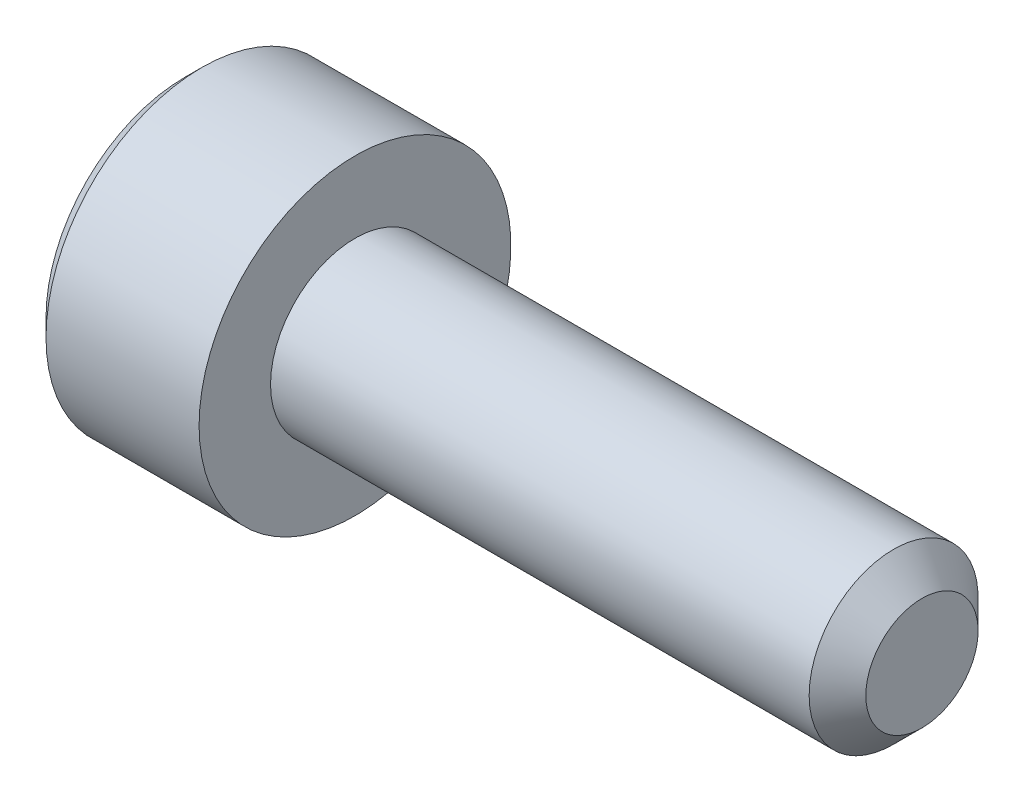
ISO-10303-21;
HEADER;
FILE_DESCRIPTION(('STEP AP214'),'2;1');
FILE_NAME('part.step','',(''),(''),'','','');
FILE_SCHEMA(('AUTOMOTIVE_DESIGN { 1 0 10303 214 1 1 1 1 }'));
ENDSEC;
DATA;
#1=APPLICATION_CONTEXT('core data for automotive mechanical design processes');
#2=APPLICATION_PROTOCOL_DEFINITION('international standard','automotive_design',2000,#1);
#3=PRODUCT_CONTEXT('',#1,'mechanical');
#4=PRODUCT('Part','Part','',(#3));
#5=PRODUCT_RELATED_PRODUCT_CATEGORY('part','',(#4));
#6=PRODUCT_DEFINITION_FORMATION('','',#4);
#7=PRODUCT_DEFINITION_CONTEXT('part definition',#1,'design');
#8=PRODUCT_DEFINITION('design','',#6,#7);
#9=PRODUCT_DEFINITION_SHAPE('','',#8);
#10=(LENGTH_UNIT() NAMED_UNIT(*) SI_UNIT(.MILLI.,.METRE.));
#11=(NAMED_UNIT(*) PLANE_ANGLE_UNIT() SI_UNIT($,.RADIAN.));
#12=(NAMED_UNIT(*) SI_UNIT($,.STERADIAN.) SOLID_ANGLE_UNIT());
#13=UNCERTAINTY_MEASURE_WITH_UNIT(LENGTH_MEASURE(1.E-05),#10,'distance_accuracy_value','');
#14=(GEOMETRIC_REPRESENTATION_CONTEXT(3) GLOBAL_UNCERTAINTY_ASSIGNED_CONTEXT((#13)) GLOBAL_UNIT_ASSIGNED_CONTEXT((#10,
#11,#12)) REPRESENTATION_CONTEXT('',''));
#15=CARTESIAN_POINT('',(0.,0.,0.));
#16=DIRECTION('',(0.,0.,1.));
#17=DIRECTION('',(1.,0.,0.));
#18=AXIS2_PLACEMENT_3D('',#15,#16,#17);
#19=CARTESIAN_POINT('',(0.,0.,0.));
#20=DIRECTION('',(1.,0.,0.));
#21=DIRECTION('',(0.,0.,-1.));
#22=AXIS2_PLACEMENT_3D('',#19,#20,#21);
#23=PLANE('',#22);
#24=DIRECTION('',(0.,0.866025403784439,0.5));
#25=VECTOR('',#24,1.);
#26=CARTESIAN_POINT('',(0.,1.4,-0.981495457622362));
#27=LINE('',#26,#25);
#28=CARTESIAN_POINT('',(0.,0.,-1.78978583448784));
#29=VERTEX_POINT('',#28);
#30=CARTESIAN_POINT('',(0.,1.55,-0.894892917243918));
#31=VERTEX_POINT('',#30);
#32=EDGE_CURVE('E154',#29,#31,#27,.T.);
#33=ORIENTED_EDGE('',*,*,#32,.T.);
#34=DIRECTION('',(0.,0.,1.));
#35=VECTOR('',#34,1.);
#36=CARTESIAN_POINT('',(0.,1.55,0.721687836487032));
#37=LINE('',#36,#35);
#38=CARTESIAN_POINT('',(0.,1.55,0.894892917243919));
#39=VERTEX_POINT('',#38);
#40=EDGE_CURVE('E164',#31,#39,#37,.T.);
#41=ORIENTED_EDGE('',*,*,#40,.T.);
#42=DIRECTION('',(0.,-0.866025403784439,0.5));
#43=VECTOR('',#42,1.);
#44=CARTESIAN_POINT('',(0.,0.15,1.7031832941094));
#45=LINE('',#44,#43);
#46=CARTESIAN_POINT('',(0.,0.,1.78978583448784));
#47=VERTEX_POINT('',#46);
#48=EDGE_CURVE('E162',#39,#47,#45,.T.);
#49=ORIENTED_EDGE('',*,*,#48,.T.);
#50=DIRECTION('',(0.,-0.866025403784439,-0.5));
#51=VECTOR('',#50,1.);
#52=CARTESIAN_POINT('',(0.,-1.4,0.981495457622364));
#53=LINE('',#52,#51);
#54=CARTESIAN_POINT('',(0.,-1.55,0.89489291724392));
#55=VERTEX_POINT('',#54);
#56=EDGE_CURVE('E160',#47,#55,#53,.T.);
#57=ORIENTED_EDGE('',*,*,#56,.T.);
#58=DIRECTION('',(0.,0.,-1.));
#59=VECTOR('',#58,1.);
#60=CARTESIAN_POINT('',(0.,-1.55,-0.721687836487031));
#61=LINE('',#60,#59);
#62=CARTESIAN_POINT('',(0.,-1.55,-0.894892917243919));
#63=VERTEX_POINT('',#62);
#64=EDGE_CURVE('E158',#55,#63,#61,.T.);
#65=ORIENTED_EDGE('',*,*,#64,.T.);
#66=DIRECTION('',(0.,0.866025403784439,-0.5));
#67=VECTOR('',#66,1.);
#68=CARTESIAN_POINT('',(0.,-0.149999999999999,-1.7031832941094));
#69=LINE('',#68,#67);
#70=EDGE_CURVE('E156',#63,#29,#69,.T.);
#71=ORIENTED_EDGE('',*,*,#70,.T.);
#72=EDGE_LOOP('',(#33,#41,#49,#57,#65,#71));
#73=FACE_BOUND('',#72,.T.);
#74=CARTESIAN_POINT('',(0.,0.,0.));
#75=DIRECTION('',(1.,0.,0.));
#76=DIRECTION('',(0.,0.,-1.));
#77=AXIS2_PLACEMENT_3D('',#74,#75,#76);
#78=CIRCLE('',#77,2.45);
#79=CARTESIAN_POINT('',(0.,0.,-2.45));
#80=VERTEX_POINT('',#79);
#81=EDGE_CURVE('E148',#80,#80,#78,.F.);
#82=ORIENTED_EDGE('',*,*,#81,.T.);
#83=EDGE_LOOP('',(#82));
#84=FACE_BOUND('',#83,.T.);
#85=ADVANCED_FACE('F33',(#73,#84),#23,.F.);
#86=CARTESIAN_POINT('',(13.,0.,0.));
#87=DIRECTION('',(-1.,0.,0.));
#88=DIRECTION('',(0.,0.,1.));
#89=AXIS2_PLACEMENT_3D('',#86,#87,#88);
#90=PLANE('',#89);
#91=CARTESIAN_POINT('',(13.,0.,0.));
#92=DIRECTION('',(-1.,0.,0.));
#93=DIRECTION('',(0.,0.,1.));
#94=AXIS2_PLACEMENT_3D('',#91,#92,#93);
#95=CIRCLE('',#94,0.989999999999989);
#96=CARTESIAN_POINT('',(13.,0.,0.989999999999989));
#97=VERTEX_POINT('',#96);
#98=EDGE_CURVE('E145',#97,#97,#95,.F.);
#99=ORIENTED_EDGE('',*,*,#98,.T.);
#100=EDGE_LOOP('',(#99));
#101=FACE_BOUND('',#100,.T.);
#102=ADVANCED_FACE('F244',(#101),#90,.F.);
#103=CARTESIAN_POINT('',(-88.7054908485857,0.,0.));
#104=DIRECTION('',(-1.,0.,0.));
#105=DIRECTION('',(0.,0.,1.));
#106=AXIS2_PLACEMENT_3D('',#103,#104,#105);
#107=CYLINDRICAL_SURFACE('',#106,1.49);
#108=CARTESIAN_POINT('',(12.5,0.,0.));
#109=DIRECTION('',(-1.,0.,0.));
#110=DIRECTION('',(0.,0.,1.));
#111=AXIS2_PLACEMENT_3D('',#108,#109,#110);
#112=CIRCLE('',#111,1.49);
#113=CARTESIAN_POINT('',(12.5,0.,1.49));
#114=VERTEX_POINT('',#113);
#115=EDGE_CURVE('E142',#114,#114,#112,.T.);
#116=ORIENTED_EDGE('',*,*,#115,.T.);
#117=EDGE_LOOP('',(#116));
#118=FACE_BOUND('',#117,.T.);
#119=CARTESIAN_POINT('',(3.,0.,0.));
#120=DIRECTION('',(-1.,0.,0.));
#121=DIRECTION('',(0.,0.,1.));
#122=AXIS2_PLACEMENT_3D('',#119,#120,#121);
#123=CIRCLE('',#122,1.49);
#124=CARTESIAN_POINT('',(3.,0.,1.49));
#125=VERTEX_POINT('',#124);
#126=EDGE_CURVE('E134',#125,#125,#123,.T.);
#127=ORIENTED_EDGE('',*,*,#126,.F.);
#128=EDGE_LOOP('',(#127));
#129=FACE_BOUND('',#128,.T.);
#130=ADVANCED_FACE('F249',(#118,#129),#107,.T.);
#131=CARTESIAN_POINT('',(3.,1.49,0.));
#132=DIRECTION('',(-1.,0.,0.));
#133=DIRECTION('',(0.,0.,1.));
#134=AXIS2_PLACEMENT_3D('',#131,#132,#133);
#135=PLANE('',#134);
#136=CARTESIAN_POINT('',(3.,0.,0.));
#137=DIRECTION('',(-1.,0.,0.));
#138=DIRECTION('',(0.,0.,1.));
#139=AXIS2_PLACEMENT_3D('',#136,#137,#138);
#140=CIRCLE('',#139,2.75);
#141=CARTESIAN_POINT('',(3.,0.,2.75));
#142=VERTEX_POINT('',#141);
#143=EDGE_CURVE('E130',#142,#142,#140,.T.);
#144=ORIENTED_EDGE('',*,*,#143,.F.);
#145=EDGE_LOOP('',(#144));
#146=FACE_BOUND('',#145,.T.);
#147=ORIENTED_EDGE('',*,*,#126,.T.);
#148=EDGE_LOOP('',(#147));
#149=FACE_BOUND('',#148,.T.);
#150=ADVANCED_FACE('F259',(#146,#149),#135,.F.);
#151=CARTESIAN_POINT('',(-88.7054908485857,0.,0.));
#152=DIRECTION('',(-1.,0.,0.));
#153=DIRECTION('',(0.,0.,1.));
#154=AXIS2_PLACEMENT_3D('',#151,#152,#153);
#155=CYLINDRICAL_SURFACE('',#154,2.75);
#156=CARTESIAN_POINT('',(0.299999999999995,0.,0.));
#157=DIRECTION('',(1.,0.,0.));
#158=DIRECTION('',(0.,0.,-1.));
#159=AXIS2_PLACEMENT_3D('',#156,#157,#158);
#160=CIRCLE('',#159,2.75);
#161=CARTESIAN_POINT('',(0.299999999999995,0.,-2.75));
#162=VERTEX_POINT('',#161);
#163=EDGE_CURVE('E151',#162,#162,#160,.T.);
#164=ORIENTED_EDGE('',*,*,#163,.T.);
#165=EDGE_LOOP('',(#164));
#166=FACE_BOUND('',#165,.T.);
#167=ORIENTED_EDGE('',*,*,#143,.T.);
#168=EDGE_LOOP('',(#167));
#169=FACE_BOUND('',#168,.T.);
#170=ADVANCED_FACE('F255',(#166,#169),#155,.T.);
#171=CARTESIAN_POINT('',(12.5,0.,0.));
#172=DIRECTION('',(-1.,0.,0.));
#173=DIRECTION('',(0.,0.,1.));
#174=AXIS2_PLACEMENT_3D('',#171,#172,#173);
#175=CONICAL_SURFACE('',#174,1.49,0.785398163397453);
#176=ORIENTED_EDGE('',*,*,#98,.F.);
#177=EDGE_LOOP('',(#176));
#178=FACE_BOUND('',#177,.T.);
#179=ORIENTED_EDGE('',*,*,#115,.F.);
#180=EDGE_LOOP('',(#179));
#181=FACE_BOUND('',#180,.T.);
#182=ADVANCED_FACE('F258',(#178,#181),#175,.T.);
#183=CARTESIAN_POINT('',(0.,0.,0.));
#184=DIRECTION('',(1.,0.,0.));
#185=DIRECTION('',(0.,0.,-1.));
#186=AXIS2_PLACEMENT_3D('',#183,#184,#185);
#187=CONICAL_SURFACE('',#186,2.45,0.785398163397455);
#188=ORIENTED_EDGE('',*,*,#163,.F.);
#189=EDGE_LOOP('',(#188));
#190=FACE_BOUND('',#189,.T.);
#191=ORIENTED_EDGE('',*,*,#81,.F.);
#192=EDGE_LOOP('',(#191));
#193=FACE_BOUND('',#192,.T.);
#194=ADVANCED_FACE('F269',(#190,#193),#187,.T.);
#195=CARTESIAN_POINT('',(2.5,1.25,0.721687836487032));
#196=DIRECTION('',(0.,-0.5,-0.866025403784438));
#197=DIRECTION('',(0.,0.866025403784439,-0.5));
#198=AXIS2_PLACEMENT_3D('',#195,#196,#197);
#199=PLANE('',#198);
#200=DIRECTION('',(-1.,0.,0.));
#201=VECTOR('',#200,1.);
#202=CARTESIAN_POINT('',(2.5,0.,1.44337567297407));
#203=LINE('',#202,#201);
#204=CARTESIAN_POINT('',(2.5,0.,1.44337567297407));
#205=VERTEX_POINT('',#204);
#206=CARTESIAN_POINT('',(0.300000000000002,0.,1.44337567297407));
#207=VERTEX_POINT('',#206);
#208=EDGE_CURVE('E122',#205,#207,#203,.T.);
#209=ORIENTED_EDGE('',*,*,#208,.T.);
#210=DIRECTION('',(0.,0.866025403784439,-0.5));
#211=VECTOR('',#210,1.);
#212=CARTESIAN_POINT('',(0.300000000000002,1.25,0.721687836487032));
#213=LINE('',#212,#211);
#214=CARTESIAN_POINT('',(0.300000000000002,1.25,0.721687836487032));
#215=VERTEX_POINT('',#214);
#216=EDGE_CURVE('E170',#207,#215,#213,.T.);
#217=ORIENTED_EDGE('',*,*,#216,.T.);
#218=DIRECTION('',(-1.,0.,0.));
#219=VECTOR('',#218,1.);
#220=CARTESIAN_POINT('',(2.5,1.25,0.721687836487032));
#221=LINE('',#220,#219);
#222=CARTESIAN_POINT('',(2.5,1.25,0.721687836487032));
#223=VERTEX_POINT('',#222);
#224=EDGE_CURVE('E125',#223,#215,#221,.T.);
#225=ORIENTED_EDGE('',*,*,#224,.F.);
#226=DIRECTION('',(0.,-0.866025403784439,0.5));
#227=VECTOR('',#226,1.);
#228=CARTESIAN_POINT('',(2.5,1.25,0.721687836487032));
#229=LINE('',#228,#227);
#230=EDGE_CURVE('E110',#223,#205,#229,.T.);
#231=ORIENTED_EDGE('',*,*,#230,.T.);
#232=EDGE_LOOP('',(#209,#217,#225,#231));
#233=FACE_BOUND('',#232,.T.);
#234=ADVANCED_FACE('F121',(#233),#199,.T.);
#235=CARTESIAN_POINT('',(2.5,0.,1.44337567297407));
#236=DIRECTION('',(0.,0.5,-0.866025403784438));
#237=DIRECTION('',(0.,0.866025403784439,0.5));
#238=AXIS2_PLACEMENT_3D('',#235,#236,#237);
#239=PLANE('',#238);
#240=DIRECTION('',(-1.,0.,0.));
#241=VECTOR('',#240,1.);
#242=CARTESIAN_POINT('',(2.5,-1.25,0.721687836487033));
#243=LINE('',#242,#241);
#244=CARTESIAN_POINT('',(2.5,-1.25,0.721687836487033));
#245=VERTEX_POINT('',#244);
#246=CARTESIAN_POINT('',(0.300000000000002,-1.25,0.721687836487033));
#247=VERTEX_POINT('',#246);
#248=EDGE_CURVE('E131',#245,#247,#243,.T.);
#249=ORIENTED_EDGE('',*,*,#248,.T.);
#250=DIRECTION('',(0.,0.866025403784439,0.5));
#251=VECTOR('',#250,1.);
#252=CARTESIAN_POINT('',(0.300000000000002,0.,1.44337567297407));
#253=LINE('',#252,#251);
#254=EDGE_CURVE('E129',#247,#207,#253,.T.);
#255=ORIENTED_EDGE('',*,*,#254,.T.);
#256=ORIENTED_EDGE('',*,*,#208,.F.);
#257=DIRECTION('',(0.,-0.866025403784439,-0.5));
#258=VECTOR('',#257,1.);
#259=CARTESIAN_POINT('',(2.5,0.,1.44337567297407));
#260=LINE('',#259,#258);
#261=EDGE_CURVE('E106',#205,#245,#260,.T.);
#262=ORIENTED_EDGE('',*,*,#261,.T.);
#263=EDGE_LOOP('',(#249,#255,#256,#262));
#264=FACE_BOUND('',#263,.T.);
#265=ADVANCED_FACE('F127',(#264),#239,.T.);
#266=CARTESIAN_POINT('',(2.5,-1.25,0.721687836487033));
#267=DIRECTION('',(0.,1.,0.));
#268=DIRECTION('',(0.,0.,1.));
#269=AXIS2_PLACEMENT_3D('',#266,#267,#268);
#270=PLANE('',#269);
#271=DIRECTION('',(-1.,0.,0.));
#272=VECTOR('',#271,1.);
#273=CARTESIAN_POINT('',(2.5,-1.25,-0.721687836487031));
#274=LINE('',#273,#272);
#275=CARTESIAN_POINT('',(2.5,-1.25,-0.721687836487031));
#276=VERTEX_POINT('',#275);
#277=CARTESIAN_POINT('',(0.300000000000002,-1.25,-0.721687836487031));
#278=VERTEX_POINT('',#277);
#279=EDGE_CURVE('E136',#276,#278,#274,.T.);
#280=ORIENTED_EDGE('',*,*,#279,.T.);
#281=DIRECTION('',(0.,0.,1.));
#282=VECTOR('',#281,1.);
#283=CARTESIAN_POINT('',(0.300000000000002,-1.25,0.721687836487033));
#284=LINE('',#283,#282);
#285=EDGE_CURVE('E173',#278,#247,#284,.T.);
#286=ORIENTED_EDGE('',*,*,#285,.T.);
#287=ORIENTED_EDGE('',*,*,#248,.F.);
#288=DIRECTION('',(0.,0.,-1.));
#289=VECTOR('',#288,1.);
#290=CARTESIAN_POINT('',(2.5,-1.25,0.721687836487033));
#291=LINE('',#290,#289);
#292=EDGE_CURVE('E112',#245,#276,#291,.T.);
#293=ORIENTED_EDGE('',*,*,#292,.T.);
#294=EDGE_LOOP('',(#280,#286,#287,#293));
#295=FACE_BOUND('',#294,.T.);
#296=ADVANCED_FACE('F200',(#295),#270,.T.);
#297=CARTESIAN_POINT('',(2.5,-1.25,-0.721687836487031));
#298=DIRECTION('',(0.,0.5,0.866025403784439));
#299=DIRECTION('',(0.,-0.866025403784439,0.5));
#300=AXIS2_PLACEMENT_3D('',#297,#298,#299);
#301=PLANE('',#300);
#302=DIRECTION('',(-1.,0.,0.));
#303=VECTOR('',#302,1.);
#304=CARTESIAN_POINT('',(2.5,0.,-1.44337567297406));
#305=LINE('',#304,#303);
#306=CARTESIAN_POINT('',(2.5,0.,-1.44337567297406));
#307=VERTEX_POINT('',#306);
#308=CARTESIAN_POINT('',(0.300000000000002,0.,-1.44337567297406));
#309=VERTEX_POINT('',#308);
#310=EDGE_CURVE('E201',#307,#309,#305,.T.);
#311=ORIENTED_EDGE('',*,*,#310,.T.);
#312=DIRECTION('',(0.,-0.866025403784439,0.5));
#313=VECTOR('',#312,1.);
#314=CARTESIAN_POINT('',(0.300000000000002,-1.25,-0.721687836487031));
#315=LINE('',#314,#313);
#316=EDGE_CURVE('E42',#309,#278,#315,.T.);
#317=ORIENTED_EDGE('',*,*,#316,.T.);
#318=ORIENTED_EDGE('',*,*,#279,.F.);
#319=DIRECTION('',(0.,0.866025403784439,-0.499999999999999));
#320=VECTOR('',#319,1.);
#321=CARTESIAN_POINT('',(2.5,-1.25,-0.721687836487031));
#322=LINE('',#321,#320);
#323=EDGE_CURVE('E211',#276,#307,#322,.T.);
#324=ORIENTED_EDGE('',*,*,#323,.T.);
#325=EDGE_LOOP('',(#311,#317,#318,#324));
#326=FACE_BOUND('',#325,.T.);
#327=ADVANCED_FACE('F213',(#326),#301,.T.);
#328=CARTESIAN_POINT('',(2.5,0.,-1.44337567297406));
#329=DIRECTION('',(0.,-0.5,0.866025403784439));
#330=DIRECTION('',(0.,-0.866025403784439,-0.5));
#331=AXIS2_PLACEMENT_3D('',#328,#329,#330);
#332=PLANE('',#331);
#333=DIRECTION('',(-1.,0.,0.));
#334=VECTOR('',#333,1.);
#335=CARTESIAN_POINT('',(2.5,1.25,-0.72168783648703));
#336=LINE('',#335,#334);
#337=CARTESIAN_POINT('',(2.5,1.25,-0.72168783648703));
#338=VERTEX_POINT('',#337);
#339=CARTESIAN_POINT('',(0.300000000000002,1.25,-0.72168783648703));
#340=VERTEX_POINT('',#339);
#341=EDGE_CURVE('E202',#338,#340,#336,.T.);
#342=ORIENTED_EDGE('',*,*,#341,.T.);
#343=DIRECTION('',(0.,-0.866025403784439,-0.5));
#344=VECTOR('',#343,1.);
#345=CARTESIAN_POINT('',(0.300000000000002,0.,-1.44337567297406));
#346=LINE('',#345,#344);
#347=EDGE_CURVE('E11',#340,#309,#346,.T.);
#348=ORIENTED_EDGE('',*,*,#347,.T.);
#349=ORIENTED_EDGE('',*,*,#310,.F.);
#350=DIRECTION('',(0.,0.866025403784438,0.5));
#351=VECTOR('',#350,1.);
#352=CARTESIAN_POINT('',(2.5,0.,-1.44337567297406));
#353=LINE('',#352,#351);
#354=EDGE_CURVE('E209',#307,#338,#353,.T.);
#355=ORIENTED_EDGE('',*,*,#354,.T.);
#356=EDGE_LOOP('',(#342,#348,#349,#355));
#357=FACE_BOUND('',#356,.T.);
#358=ADVANCED_FACE('F215',(#357),#332,.T.);
#359=CARTESIAN_POINT('',(2.5,1.25,-0.72168783648703));
#360=DIRECTION('',(0.,-1.,0.));
#361=DIRECTION('',(0.,0.,-1.));
#362=AXIS2_PLACEMENT_3D('',#359,#360,#361);
#363=PLANE('',#362);
#364=ORIENTED_EDGE('',*,*,#224,.T.);
#365=DIRECTION('',(0.,0.,-1.));
#366=VECTOR('',#365,1.);
#367=CARTESIAN_POINT('',(0.300000000000002,1.25,-0.72168783648703));
#368=LINE('',#367,#366);
#369=EDGE_CURVE('E167',#215,#340,#368,.T.);
#370=ORIENTED_EDGE('',*,*,#369,.T.);
#371=ORIENTED_EDGE('',*,*,#341,.F.);
#372=DIRECTION('',(0.,0.,1.));
#373=VECTOR('',#372,1.);
#374=CARTESIAN_POINT('',(2.5,1.25,-0.72168783648703));
#375=LINE('',#374,#373);
#376=EDGE_CURVE('E207',#338,#223,#375,.T.);
#377=ORIENTED_EDGE('',*,*,#376,.T.);
#378=EDGE_LOOP('',(#364,#370,#371,#377));
#379=FACE_BOUND('',#378,.T.);
#380=ADVANCED_FACE('F218',(#379),#363,.T.);
#381=CARTESIAN_POINT('',(2.5,0.,0.));
#382=DIRECTION('',(1.,0.,0.));
#383=DIRECTION('',(0.,0.,-1.));
#384=AXIS2_PLACEMENT_3D('',#381,#382,#383);
#385=PLANE('',#384);
#386=ORIENTED_EDGE('',*,*,#230,.F.);
#387=ORIENTED_EDGE('',*,*,#376,.F.);
#388=ORIENTED_EDGE('',*,*,#354,.F.);
#389=ORIENTED_EDGE('',*,*,#323,.F.);
#390=ORIENTED_EDGE('',*,*,#292,.F.);
#391=ORIENTED_EDGE('',*,*,#261,.F.);
#392=EDGE_LOOP('',(#386,#387,#388,#389,#390,#391));
#393=FACE_BOUND('',#392,.T.);
#394=ADVANCED_FACE('F108',(#393),#385,.F.);
#395=CARTESIAN_POINT('',(0.,-1.55,0.));
#396=DIRECTION('',(-0.707106781186546,0.70710678118655,0.));
#397=DIRECTION('',(0.,0.,1.));
#398=AXIS2_PLACEMENT_3D('',#395,#396,#397);
#399=PLANE('',#398);
#400=DIRECTION('',(0.654653670707979,0.654653670707976,-0.377964473009226));
#401=VECTOR('',#400,1.);
#402=CARTESIAN_POINT('',(0.221428571428572,-1.32857142857143,0.767051071923361));
#403=LINE('',#402,#401);
#404=EDGE_CURVE('E185',#247,#55,#403,.F.);
#405=ORIENTED_EDGE('',*,*,#404,.F.);
#406=ORIENTED_EDGE('',*,*,#285,.F.);
#407=DIRECTION('',(0.654653670707979,0.654653670707975,0.377964473009226));
#408=VECTOR('',#407,1.);
#409=CARTESIAN_POINT('',(0.221428571428572,-1.32857142857143,-0.76705107192336));
#410=LINE('',#409,#408);
#411=EDGE_CURVE('E37',#63,#278,#410,.T.);
#412=ORIENTED_EDGE('',*,*,#411,.F.);
#413=ORIENTED_EDGE('',*,*,#64,.F.);
#414=EDGE_LOOP('',(#405,#406,#412,#413));
#415=FACE_BOUND('',#414,.T.);
#416=ADVANCED_FACE('F35',(#415),#399,.T.);
#417=CARTESIAN_POINT('',(0.,-0.774999999999999,-1.34233937586588));
#418=DIRECTION('',(-0.707106781186546,0.353553390593274,0.612372435695797));
#419=DIRECTION('',(0.,-0.866025403784439,0.5));
#420=AXIS2_PLACEMENT_3D('',#417,#418,#419);
#421=PLANE('',#420);
#422=ORIENTED_EDGE('',*,*,#411,.T.);
#423=ORIENTED_EDGE('',*,*,#316,.F.);
#424=DIRECTION('',(0.654653670707979,0.,0.755928946018452));
#425=VECTOR('',#424,1.);
#426=CARTESIAN_POINT('',(0.221428571428571,0.,-1.53410214384672));
#427=LINE('',#426,#425);
#428=EDGE_CURVE('E183',#29,#309,#427,.T.);
#429=ORIENTED_EDGE('',*,*,#428,.F.);
#430=ORIENTED_EDGE('',*,*,#70,.F.);
#431=EDGE_LOOP('',(#422,#423,#429,#430));
#432=FACE_BOUND('',#431,.T.);
#433=ADVANCED_FACE('F194',(#432),#421,.T.);
#434=CARTESIAN_POINT('',(0.,-0.775000000000001,1.34233937586588));
#435=DIRECTION('',(-0.707106781186545,0.353553390593275,-0.612372435695796));
#436=DIRECTION('',(0.,0.866025403784439,0.5));
#437=AXIS2_PLACEMENT_3D('',#434,#435,#436);
#438=PLANE('',#437);
#439=ORIENTED_EDGE('',*,*,#404,.T.);
#440=ORIENTED_EDGE('',*,*,#56,.F.);
#441=DIRECTION('',(0.654653670707979,0.,-0.755928946018452));
#442=VECTOR('',#441,1.);
#443=CARTESIAN_POINT('',(0.221428571428572,0.,1.53410214384672));
#444=LINE('',#443,#442);
#445=EDGE_CURVE('E180',#207,#47,#444,.F.);
#446=ORIENTED_EDGE('',*,*,#445,.F.);
#447=ORIENTED_EDGE('',*,*,#254,.F.);
#448=EDGE_LOOP('',(#439,#440,#446,#447));
#449=FACE_BOUND('',#448,.T.);
#450=ADVANCED_FACE('F235',(#449),#438,.T.);
#451=CARTESIAN_POINT('',(0.,0.775,-1.34233937586588));
#452=DIRECTION('',(-0.707106781186545,-0.353553390593275,0.612372435695796));
#453=DIRECTION('',(0.,-0.866025403784439,-0.5));
#454=AXIS2_PLACEMENT_3D('',#451,#452,#453);
#455=PLANE('',#454);
#456=ORIENTED_EDGE('',*,*,#428,.T.);
#457=ORIENTED_EDGE('',*,*,#347,.F.);
#458=DIRECTION('',(-0.654653670707979,0.654653670707976,-0.377964473009226));
#459=VECTOR('',#458,1.);
#460=CARTESIAN_POINT('',(0.221428571428571,1.32857142857143,-0.767051071923359));
#461=LINE('',#460,#459);
#462=EDGE_CURVE('E178',#31,#340,#461,.F.);
#463=ORIENTED_EDGE('',*,*,#462,.F.);
#464=ORIENTED_EDGE('',*,*,#32,.F.);
#465=EDGE_LOOP('',(#456,#457,#463,#464));
#466=FACE_BOUND('',#465,.T.);
#467=ADVANCED_FACE('F233',(#466),#455,.T.);
#468=CARTESIAN_POINT('',(0.,0.775,1.34233937586588));
#469=DIRECTION('',(-0.707106781186545,-0.353553390593275,-0.612372435695796));
#470=DIRECTION('',(0.,0.866025403784439,-0.5));
#471=AXIS2_PLACEMENT_3D('',#468,#469,#470);
#472=PLANE('',#471);
#473=ORIENTED_EDGE('',*,*,#445,.T.);
#474=ORIENTED_EDGE('',*,*,#48,.F.);
#475=DIRECTION('',(0.654653670707979,-0.654653670707976,-0.377964473009226));
#476=VECTOR('',#475,1.);
#477=CARTESIAN_POINT('',(0.221428571428571,1.32857142857143,0.76705107192336));
#478=LINE('',#477,#476);
#479=EDGE_CURVE('E176',#215,#39,#478,.F.);
#480=ORIENTED_EDGE('',*,*,#479,.F.);
#481=ORIENTED_EDGE('',*,*,#216,.F.);
#482=EDGE_LOOP('',(#473,#474,#480,#481));
#483=FACE_BOUND('',#482,.T.);
#484=ADVANCED_FACE('F228',(#483),#472,.T.);
#485=CARTESIAN_POINT('',(0.,1.55,0.));
#486=DIRECTION('',(-0.707106781186546,-0.70710678118655,0.));
#487=DIRECTION('',(0.,0.,-1.));
#488=AXIS2_PLACEMENT_3D('',#485,#486,#487);
#489=PLANE('',#488);
#490=ORIENTED_EDGE('',*,*,#462,.T.);
#491=ORIENTED_EDGE('',*,*,#369,.F.);
#492=ORIENTED_EDGE('',*,*,#479,.T.);
#493=ORIENTED_EDGE('',*,*,#40,.F.);
#494=EDGE_LOOP('',(#490,#491,#492,#493));
#495=FACE_BOUND('',#494,.T.);
#496=ADVANCED_FACE('F222',(#495),#489,.T.);
#497=CLOSED_SHELL('',(#85,#102,#130,#150,#170,#182,#194,#234,#265,#296,#327,#358,#380,#394,#416,
#433,#450,#467,#484,#496));
#498=MANIFOLD_SOLID_BREP('B2',#497);
#499=ADVANCED_BREP_SHAPE_REPRESENTATION('',(#18,#498),#14);
#500=SHAPE_DEFINITION_REPRESENTATION(#9,#499);
ENDSEC;
END-ISO-10303-21;
